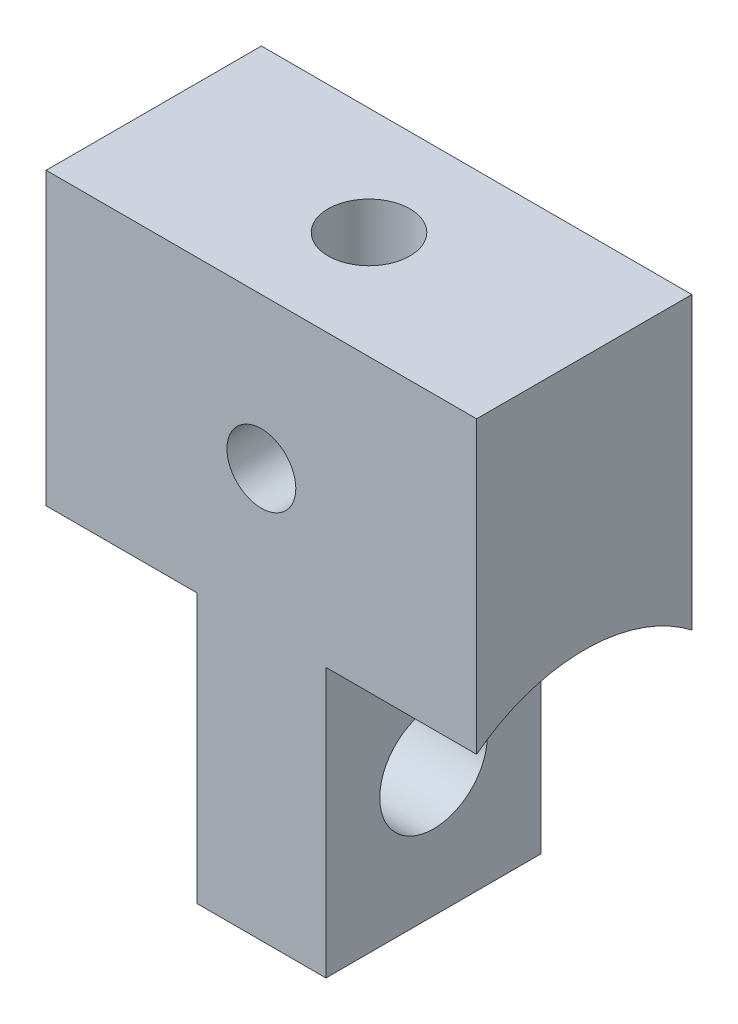
ISO-10303-21;
HEADER;
FILE_DESCRIPTION(('STEP AP214'),'2;1');
FILE_NAME('part.step','',(''),(''),'','','');
FILE_SCHEMA(('AUTOMOTIVE_DESIGN { 1 0 10303 214 1 1 1 1 }'));
ENDSEC;
DATA;
#1=APPLICATION_CONTEXT('core data for automotive mechanical design processes');
#2=APPLICATION_PROTOCOL_DEFINITION('international standard','automotive_design',2000,#1);
#3=PRODUCT_CONTEXT('',#1,'mechanical');
#4=PRODUCT('Part','Part','',(#3));
#5=PRODUCT_RELATED_PRODUCT_CATEGORY('part','',(#4));
#6=PRODUCT_DEFINITION_FORMATION('','',#4);
#7=PRODUCT_DEFINITION_CONTEXT('part definition',#1,'design');
#8=PRODUCT_DEFINITION('design','',#6,#7);
#9=PRODUCT_DEFINITION_SHAPE('','',#8);
#10=(LENGTH_UNIT() NAMED_UNIT(*) SI_UNIT(.MILLI.,.METRE.));
#11=(NAMED_UNIT(*) PLANE_ANGLE_UNIT() SI_UNIT($,.RADIAN.));
#12=(NAMED_UNIT(*) SI_UNIT($,.STERADIAN.) SOLID_ANGLE_UNIT());
#13=UNCERTAINTY_MEASURE_WITH_UNIT(LENGTH_MEASURE(1.E-05),#10,'distance_accuracy_value','');
#14=(GEOMETRIC_REPRESENTATION_CONTEXT(3) GLOBAL_UNCERTAINTY_ASSIGNED_CONTEXT((#13)) GLOBAL_UNIT_ASSIGNED_CONTEXT((#10,
#11,#12)) REPRESENTATION_CONTEXT('',''));
#15=CARTESIAN_POINT('',(0.,0.,0.));
#16=DIRECTION('',(0.,0.,1.));
#17=DIRECTION('',(1.,0.,0.));
#18=AXIS2_PLACEMENT_3D('',#15,#16,#17);
#19=CARTESIAN_POINT('',(0.,3.,5.));
#20=DIRECTION('',(0.,0.,-1.));
#21=DIRECTION('',(-1.,0.,0.));
#22=AXIS2_PLACEMENT_3D('',#19,#20,#21);
#23=CYLINDRICAL_SURFACE('',#22,0.8);
#24=CARTESIAN_POINT('',(0.,3.,5.));
#25=DIRECTION('',(0.,0.,1.));
#26=DIRECTION('',(1.,0.,0.));
#27=AXIS2_PLACEMENT_3D('',#24,#25,#26);
#28=CIRCLE('',#27,0.8);
#29=CARTESIAN_POINT('',(0.800000000000001,3.,5.));
#30=VERTEX_POINT('',#29);
#31=EDGE_CURVE('E179',#30,#30,#28,.T.);
#32=ORIENTED_EDGE('',*,*,#31,.T.);
#33=EDGE_LOOP('',(#32));
#34=FACE_BOUND('',#33,.T.);
#35=CARTESIAN_POINT('',(0.,3.,0.));
#36=DIRECTION('',(0.,0.,1.));
#37=DIRECTION('',(1.,0.,0.));
#38=AXIS2_PLACEMENT_3D('',#35,#36,#37);
#39=CIRCLE('',#38,0.8);
#40=CARTESIAN_POINT('',(0.800000000000001,3.,0.));
#41=VERTEX_POINT('',#40);
#42=EDGE_CURVE('E182',#41,#41,#39,.T.);
#43=ORIENTED_EDGE('',*,*,#42,.F.);
#44=EDGE_LOOP('',(#43));
#45=FACE_BOUND('',#44,.T.);
#46=CARTESIAN_POINT('',(0.624499799839844,3.5,3.21589105316382));
#47=CARTESIAN_POINT('',(0.596989446796808,3.53431435195809,3.23993184582808));
#48=CARTESIAN_POINT('',(0.566468990810766,3.56666598593497,3.26371468114399));
#49=CARTESIAN_POINT('',(0.499286045978184,3.62671853094582,3.30923352889173));
#50=CARTESIAN_POINT('',(0.462574101086611,3.65437807795749,3.33095066272691));
#51=CARTESIAN_POINT('',(0.391305200270369,3.69875943218527,3.36639071111825));
#52=CARTESIAN_POINT('',(0.357795075269994,3.71656229625455,3.38084325634962));
#53=CARTESIAN_POINT('',(0.287540557068154,3.74752169735336,3.40620513563468));
#54=CARTESIAN_POINT('',(0.250806353350745,3.76069225753749,3.41712515533806));
#55=CARTESIAN_POINT('',(0.174463699321532,3.78175562211247,3.43467004602641));
#56=CARTESIAN_POINT('',(0.13483229322757,3.78959970272312,3.44125524814546));
#57=CARTESIAN_POINT('',(0.0543042388616852,3.79918202346721,3.44930746544825));
#58=CARTESIAN_POINT('',(0.0134077265736145,3.80092091755081,3.45077502880195));
#59=CARTESIAN_POINT('',(-0.0625935805584883,3.79833165295423,3.44859555518797));
#60=CARTESIAN_POINT('',(-0.097747850614442,3.79477678136385,3.44560037974004));
#61=CARTESIAN_POINT('',(-0.166755012029901,3.78320871800817,3.43589855359897));
#62=CARTESIAN_POINT('',(-0.20060858744674,3.77519790498292,3.42919388317638));
#63=CARTESIAN_POINT('',(-0.266489482012972,3.75510255006901,3.41249541575778));
#64=CARTESIAN_POINT('',(-0.298501730583745,3.74298880799513,3.40247805506654));
#65=CARTESIAN_POINT('',(-0.360005326211795,3.71521846927709,3.37975887461044));
#66=CARTESIAN_POINT('',(-0.389490197726707,3.69955312600749,3.36705043263298));
#67=CARTESIAN_POINT('',(-0.458273036588351,3.65747385956863,3.33338875386017));
#68=CARTESIAN_POINT('',(-0.495993749193683,3.62939982473765,3.31130311992539));
#69=CARTESIAN_POINT('',(-0.565010201617233,3.56821065625755,3.26485374494461));
#70=CARTESIAN_POINT('',(-0.596343031870748,3.53512668852513,3.2405044244332));
#71=CARTESIAN_POINT('',(-0.624499799839841,3.5,3.21589105316381));
#72=B_SPLINE_CURVE_WITH_KNOTS('',3,(#46,#47,#48,#49,#50,#51,#52,#53,#54,#55,#56,#57,#58,#59,#60,
#61,#62,#63,#64,#65,#66,#67,#68,#69,#70,#71),.UNSPECIFIED.,.F.,.F.,(4,2,2,2,2,2,2,2,2,2,2,2,4),
(0.,0.150540881245239,0.302346746946312,0.423678394160233,0.544639512769526,0.666692728387727,
0.788732870015018,0.894604193645646,1.00041905356436,1.10700338996258,1.21385312209222,
1.36892840745186,1.52307587518184),.UNSPECIFIED.);
#73=CARTESIAN_POINT('',(0.624499799839844,3.5,3.21589105316382));
#74=VERTEX_POINT('',#73);
#75=CARTESIAN_POINT('',(-0.624499799839841,3.5,3.21589105316381));
#76=VERTEX_POINT('',#75);
#77=EDGE_CURVE('E43',#74,#76,#72,.T.);
#78=ORIENTED_EDGE('',*,*,#77,.F.);
#79=DIRECTION('',(0.,0.,-1.));
#80=VECTOR('',#79,1.);
#81=CARTESIAN_POINT('',(0.624499799839844,3.5,5.));
#82=LINE('',#81,#80);
#83=CARTESIAN_POINT('',(0.624499799839844,3.5,1.78410894683618));
#84=VERTEX_POINT('',#83);
#85=EDGE_CURVE('E12',#74,#84,#82,.T.);
#86=ORIENTED_EDGE('',*,*,#85,.T.);
#87=CARTESIAN_POINT('',(-0.624499799839841,3.5,1.78410894683619));
#88=CARTESIAN_POINT('',(-0.596989446796805,3.53431435195809,1.76006815417192));
#89=CARTESIAN_POINT('',(-0.566468990810763,3.56666598593497,1.73628531885602));
#90=CARTESIAN_POINT('',(-0.499286045978182,3.62671853094582,1.69076647110827));
#91=CARTESIAN_POINT('',(-0.462574101086608,3.65437807795749,1.66904933727309));
#92=CARTESIAN_POINT('',(-0.391305200270366,3.69875943218527,1.63360928888175));
#93=CARTESIAN_POINT('',(-0.357795075269991,3.71656229625455,1.61915674365038));
#94=CARTESIAN_POINT('',(-0.287540557068151,3.74752169735336,1.59379486436532));
#95=CARTESIAN_POINT('',(-0.250806353350742,3.76069225753749,1.58287484466194));
#96=CARTESIAN_POINT('',(-0.174463699321529,3.78175562211247,1.56532995397359));
#97=CARTESIAN_POINT('',(-0.134832293227568,3.78959970272312,1.55874475185454));
#98=CARTESIAN_POINT('',(-0.0543042388616826,3.79918202346721,1.55069253455175));
#99=CARTESIAN_POINT('',(-0.0134077265736119,3.80092091755081,1.54922497119805));
#100=CARTESIAN_POINT('',(0.0625935805584909,3.79833165295423,1.55140444481203));
#101=CARTESIAN_POINT('',(0.0977478506144447,3.79477678136385,1.55439962025996));
#102=CARTESIAN_POINT('',(0.166755012029903,3.78320871800817,1.56410144640103));
#103=CARTESIAN_POINT('',(0.200608587446743,3.77519790498292,1.57080611682362));
#104=CARTESIAN_POINT('',(0.266489482012974,3.75510255006901,1.58750458424222));
#105=CARTESIAN_POINT('',(0.298501730583748,3.74298880799513,1.59752194493345));
#106=CARTESIAN_POINT('',(0.360005326211798,3.71521846927709,1.62024112538956));
#107=CARTESIAN_POINT('',(0.38949019772671,3.69955312600749,1.63294956736702));
#108=CARTESIAN_POINT('',(0.458273036588353,3.65747385956863,1.66661124613983));
#109=CARTESIAN_POINT('',(0.495993749193685,3.62939982473764,1.6886968800746));
#110=CARTESIAN_POINT('',(0.565010201617235,3.56821065625755,1.73514625505539));
#111=CARTESIAN_POINT('',(0.596343031870751,3.53512668852512,1.7594955755668));
#112=CARTESIAN_POINT('',(0.624499799839844,3.5,1.78410894683618));
#113=B_SPLINE_CURVE_WITH_KNOTS('',3,(#87,#88,#89,#90,#91,#92,#93,#94,#95,#96,#97,#98,#99,#100,
#101,#102,#103,#104,#105,#106,#107,#108,#109,#110,#111,#112),.UNSPECIFIED.,.F.,.F.,(4,2,2,2,2,2,
2,2,2,2,2,2,4),(0.,0.15054088124524,0.302346746946313,0.423678394160234,0.544639512769527,
0.666692728387727,0.788732870015018,0.894604193645646,1.00041905356436,1.10700338996258,
1.21385312209222,1.36892840745186,1.52307587518184),.UNSPECIFIED.);
#114=CARTESIAN_POINT('',(-0.624499799839841,3.5,1.78410894683619));
#115=VERTEX_POINT('',#114);
#116=EDGE_CURVE('E122',#115,#84,#113,.T.);
#117=ORIENTED_EDGE('',*,*,#116,.F.);
#118=DIRECTION('',(0.,0.,-1.));
#119=VECTOR('',#118,1.);
#120=CARTESIAN_POINT('',(-0.624499799839841,3.5,5.));
#121=LINE('',#120,#119);
#122=EDGE_CURVE('E125',#115,#76,#121,.F.);
#123=ORIENTED_EDGE('',*,*,#122,.T.);
#124=EDGE_LOOP('',(#78,#86,#117,#123));
#125=FACE_BOUND('',#124,.T.);
#126=ADVANCED_FACE('F35',(#34,#45,#125),#23,.F.);
#127=CARTESIAN_POINT('',(0.,0.,5.));
#128=DIRECTION('',(0.,0.,-1.));
#129=DIRECTION('',(-1.,0.,0.));
#130=AXIS2_PLACEMENT_3D('',#127,#128,#129);
#131=PLANE('',#130);
#132=ORIENTED_EDGE('',*,*,#31,.F.);
#133=EDGE_LOOP('',(#132));
#134=FACE_BOUND('',#133,.T.);
#135=DIRECTION('',(1.,0.,0.));
#136=VECTOR('',#135,1.);
#137=CARTESIAN_POINT('',(-11.5965512114594,-0.250384638145621,5.));
#138=LINE('',#137,#136);
#139=CARTESIAN_POINT('',(5.,-0.250384638145624,5.));
#140=VERTEX_POINT('',#139);
#141=CARTESIAN_POINT('',(1.5,-0.250384638145623,5.));
#142=VERTEX_POINT('',#141);
#143=EDGE_CURVE('E243',#140,#142,#138,.F.);
#144=ORIENTED_EDGE('',*,*,#143,.F.);
#145=DIRECTION('',(0.,1.,0.));
#146=VECTOR('',#145,1.);
#147=CARTESIAN_POINT('',(5.,-6.50000000000001,5.));
#148=LINE('',#147,#146);
#149=CARTESIAN_POINT('',(5.,6.49999999999999,5.));
#150=VERTEX_POINT('',#149);
#151=EDGE_CURVE('E192',#140,#150,#148,.T.);
#152=ORIENTED_EDGE('',*,*,#151,.T.);
#153=DIRECTION('',(-1.,0.,0.));
#154=VECTOR('',#153,1.);
#155=CARTESIAN_POINT('',(-5.,6.5,5.));
#156=LINE('',#155,#154);
#157=CARTESIAN_POINT('',(-5.,6.5,5.));
#158=VERTEX_POINT('',#157);
#159=EDGE_CURVE('E194',#150,#158,#156,.T.);
#160=ORIENTED_EDGE('',*,*,#159,.T.);
#161=DIRECTION('',(0.,-1.,0.));
#162=VECTOR('',#161,1.);
#163=CARTESIAN_POINT('',(-4.99999999999999,-6.50000000000001,5.));
#164=LINE('',#163,#162);
#165=CARTESIAN_POINT('',(-5.,-0.250384638145624,5.));
#166=VERTEX_POINT('',#165);
#167=EDGE_CURVE('E197',#158,#166,#164,.T.);
#168=ORIENTED_EDGE('',*,*,#167,.T.);
#169=DIRECTION('',(-1.,0.,0.));
#170=VECTOR('',#169,1.);
#171=CARTESIAN_POINT('',(11.5965512114594,-0.250384638145621,5.));
#172=LINE('',#171,#170);
#173=CARTESIAN_POINT('',(-1.5,-0.250384638145624,5.));
#174=VERTEX_POINT('',#173);
#175=EDGE_CURVE('E184',#166,#174,#172,.F.);
#176=ORIENTED_EDGE('',*,*,#175,.T.);
#177=DIRECTION('',(0.,-1.,0.));
#178=VECTOR('',#177,1.);
#179=CARTESIAN_POINT('',(-1.5,0.,5.));
#180=LINE('',#179,#178);
#181=CARTESIAN_POINT('',(-1.5,-6.50000000000001,5.));
#182=VERTEX_POINT('',#181);
#183=EDGE_CURVE('E252',#174,#182,#180,.T.);
#184=ORIENTED_EDGE('',*,*,#183,.T.);
#185=DIRECTION('',(1.,0.,0.));
#186=VECTOR('',#185,1.);
#187=CARTESIAN_POINT('',(-4.99999999999999,-6.50000000000001,5.));
#188=LINE('',#187,#186);
#189=CARTESIAN_POINT('',(1.5,-6.50000000000001,5.));
#190=VERTEX_POINT('',#189);
#191=EDGE_CURVE('E200',#182,#190,#188,.T.);
#192=ORIENTED_EDGE('',*,*,#191,.T.);
#193=DIRECTION('',(0.,-1.,0.));
#194=VECTOR('',#193,1.);
#195=CARTESIAN_POINT('',(1.5,0.,5.));
#196=LINE('',#195,#194);
#197=EDGE_CURVE('E57',#142,#190,#196,.T.);
#198=ORIENTED_EDGE('',*,*,#197,.F.);
#199=EDGE_LOOP('',(#144,#152,#160,#168,#176,#184,#192,#198));
#200=FACE_BOUND('',#199,.T.);
#201=ADVANCED_FACE('F169',(#134,#200),#131,.F.);
#202=CARTESIAN_POINT('',(0.,0.,0.));
#203=DIRECTION('',(0.,0.,-1.));
#204=DIRECTION('',(-1.,0.,0.));
#205=AXIS2_PLACEMENT_3D('',#202,#203,#204);
#206=PLANE('',#205);
#207=ORIENTED_EDGE('',*,*,#42,.T.);
#208=EDGE_LOOP('',(#207));
#209=FACE_BOUND('',#208,.T.);
#210=DIRECTION('',(0.,1.,0.));
#211=VECTOR('',#210,1.);
#212=CARTESIAN_POINT('',(5.,-6.50000000000001,0.));
#213=LINE('',#212,#211);
#214=CARTESIAN_POINT('',(5.,-0.250384638145624,0.));
#215=VERTEX_POINT('',#214);
#216=CARTESIAN_POINT('',(5.,6.49999999999999,0.));
#217=VERTEX_POINT('',#216);
#218=EDGE_CURVE('E186',#215,#217,#213,.T.);
#219=ORIENTED_EDGE('',*,*,#218,.F.);
#220=DIRECTION('',(1.,0.,0.));
#221=VECTOR('',#220,1.);
#222=CARTESIAN_POINT('',(-11.5965512114594,-0.250384638145621,0.));
#223=LINE('',#222,#221);
#224=CARTESIAN_POINT('',(1.5,-0.250384638145623,0.));
#225=VERTEX_POINT('',#224);
#226=EDGE_CURVE('E240',#215,#225,#223,.F.);
#227=ORIENTED_EDGE('',*,*,#226,.T.);
#228=DIRECTION('',(0.,-1.,0.));
#229=VECTOR('',#228,1.);
#230=CARTESIAN_POINT('',(1.5,0.,0.));
#231=LINE('',#230,#229);
#232=CARTESIAN_POINT('',(1.5,-6.50000000000001,0.));
#233=VERTEX_POINT('',#232);
#234=EDGE_CURVE('E235',#225,#233,#231,.T.);
#235=ORIENTED_EDGE('',*,*,#234,.T.);
#236=DIRECTION('',(1.,0.,0.));
#237=VECTOR('',#236,1.);
#238=CARTESIAN_POINT('',(-4.99999999999999,-6.50000000000001,0.));
#239=LINE('',#238,#237);
#240=CARTESIAN_POINT('',(-1.5,-6.50000000000001,0.));
#241=VERTEX_POINT('',#240);
#242=EDGE_CURVE('E195',#241,#233,#239,.T.);
#243=ORIENTED_EDGE('',*,*,#242,.F.);
#244=DIRECTION('',(0.,-1.,0.));
#245=VECTOR('',#244,1.);
#246=CARTESIAN_POINT('',(-1.5,0.,0.));
#247=LINE('',#246,#245);
#248=CARTESIAN_POINT('',(-1.5,-0.250384638145624,0.));
#249=VERTEX_POINT('',#248);
#250=EDGE_CURVE('E250',#249,#241,#247,.T.);
#251=ORIENTED_EDGE('',*,*,#250,.F.);
#252=DIRECTION('',(-1.,0.,0.));
#253=VECTOR('',#252,1.);
#254=CARTESIAN_POINT('',(11.5965512114594,-0.250384638145621,0.));
#255=LINE('',#254,#253);
#256=CARTESIAN_POINT('',(-5.,-0.250384638145624,0.));
#257=VERTEX_POINT('',#256);
#258=EDGE_CURVE('E189',#257,#249,#255,.F.);
#259=ORIENTED_EDGE('',*,*,#258,.F.);
#260=DIRECTION('',(0.,-1.,0.));
#261=VECTOR('',#260,1.);
#262=CARTESIAN_POINT('',(-4.99999999999999,-6.50000000000001,0.));
#263=LINE('',#262,#261);
#264=CARTESIAN_POINT('',(-5.,6.5,0.));
#265=VERTEX_POINT('',#264);
#266=EDGE_CURVE('E207',#265,#257,#263,.T.);
#267=ORIENTED_EDGE('',*,*,#266,.F.);
#268=DIRECTION('',(-1.,0.,0.));
#269=VECTOR('',#268,1.);
#270=CARTESIAN_POINT('',(-5.,6.5,0.));
#271=LINE('',#270,#269);
#272=EDGE_CURVE('E205',#217,#265,#271,.T.);
#273=ORIENTED_EDGE('',*,*,#272,.F.);
#274=EDGE_LOOP('',(#219,#227,#235,#243,#251,#259,#267,#273));
#275=FACE_BOUND('',#274,.T.);
#276=ADVANCED_FACE('F174',(#209,#275),#206,.T.);
#277=CARTESIAN_POINT('',(-4.99999999999999,-6.50000000000001,5.));
#278=DIRECTION('',(0.,1.,0.));
#279=DIRECTION('',(-1.,0.,0.));
#280=AXIS2_PLACEMENT_3D('',#277,#278,#279);
#281=PLANE('',#280);
#282=DIRECTION('',(0.,0.,-1.));
#283=VECTOR('',#282,1.);
#284=CARTESIAN_POINT('',(1.5,-6.50000000000001,5.));
#285=LINE('',#284,#283);
#286=EDGE_CURVE('E220',#190,#233,#285,.T.);
#287=ORIENTED_EDGE('',*,*,#286,.F.);
#288=ORIENTED_EDGE('',*,*,#191,.F.);
#289=DIRECTION('',(0.,0.,-1.));
#290=VECTOR('',#289,1.);
#291=CARTESIAN_POINT('',(-1.5,-6.50000000000001,5.));
#292=LINE('',#291,#290);
#293=EDGE_CURVE('E217',#182,#241,#292,.T.);
#294=ORIENTED_EDGE('',*,*,#293,.T.);
#295=ORIENTED_EDGE('',*,*,#242,.T.);
#296=EDGE_LOOP('',(#287,#288,#294,#295));
#297=FACE_BOUND('',#296,.T.);
#298=ADVANCED_FACE('F264',(#297),#281,.F.);
#299=CARTESIAN_POINT('',(5.,-6.50000000000001,5.));
#300=DIRECTION('',(-1.,0.,0.));
#301=DIRECTION('',(0.,-1.,0.));
#302=AXIS2_PLACEMENT_3D('',#299,#300,#301);
#303=PLANE('',#302);
#304=CARTESIAN_POINT('',(4.99999999999999,-3.50000000000001,2.5));
#305=DIRECTION('',(-1.,0.,0.));
#306=DIRECTION('',(0.,-1.,0.));
#307=AXIS2_PLACEMENT_3D('',#304,#305,#306);
#308=CIRCLE('',#307,4.1);
#309=EDGE_CURVE('E224',#140,#215,#308,.T.);
#310=ORIENTED_EDGE('',*,*,#309,.T.);
#311=ORIENTED_EDGE('',*,*,#218,.T.);
#312=DIRECTION('',(0.,0.,-1.));
#313=VECTOR('',#312,1.);
#314=CARTESIAN_POINT('',(5.,6.49999999999999,5.));
#315=LINE('',#314,#313);
#316=EDGE_CURVE('E214',#150,#217,#315,.T.);
#317=ORIENTED_EDGE('',*,*,#316,.F.);
#318=ORIENTED_EDGE('',*,*,#151,.F.);
#319=EDGE_LOOP('',(#310,#311,#317,#318));
#320=FACE_BOUND('',#319,.T.);
#321=ADVANCED_FACE('F37',(#320),#303,.F.);
#322=CARTESIAN_POINT('',(-5.,6.5,5.));
#323=DIRECTION('',(0.,-1.,0.));
#324=DIRECTION('',(1.,0.,0.));
#325=AXIS2_PLACEMENT_3D('',#322,#323,#324);
#326=PLANE('',#325);
#327=CARTESIAN_POINT('',(0.,6.5,2.5));
#328=DIRECTION('',(0.,1.,0.));
#329=DIRECTION('',(-1.,0.,0.));
#330=AXIS2_PLACEMENT_3D('',#327,#328,#329);
#331=CIRCLE('',#330,0.95);
#332=CARTESIAN_POINT('',(-0.949999999999996,6.5,2.5));
#333=VERTEX_POINT('',#332);
#334=EDGE_CURVE('E234',#333,#333,#331,.T.);
#335=ORIENTED_EDGE('',*,*,#334,.F.);
#336=EDGE_LOOP('',(#335));
#337=FACE_BOUND('',#336,.T.);
#338=ORIENTED_EDGE('',*,*,#272,.T.);
#339=DIRECTION('',(0.,0.,-1.));
#340=VECTOR('',#339,1.);
#341=CARTESIAN_POINT('',(-5.,6.5,5.));
#342=LINE('',#341,#340);
#343=EDGE_CURVE('E203',#158,#265,#342,.T.);
#344=ORIENTED_EDGE('',*,*,#343,.F.);
#345=ORIENTED_EDGE('',*,*,#159,.F.);
#346=ORIENTED_EDGE('',*,*,#316,.T.);
#347=EDGE_LOOP('',(#338,#344,#345,#346));
#348=FACE_BOUND('',#347,.T.);
#349=ADVANCED_FACE('F275',(#337,#348),#326,.F.);
#350=CARTESIAN_POINT('',(-4.99999999999999,-6.50000000000001,5.));
#351=DIRECTION('',(1.,0.,0.));
#352=DIRECTION('',(0.,1.,0.));
#353=AXIS2_PLACEMENT_3D('',#350,#351,#352);
#354=PLANE('',#353);
#355=ORIENTED_EDGE('',*,*,#266,.T.);
#356=CARTESIAN_POINT('',(-4.99999999999999,-3.50000000000001,2.5));
#357=DIRECTION('',(-1.,0.,0.));
#358=DIRECTION('',(0.,-1.,0.));
#359=AXIS2_PLACEMENT_3D('',#356,#357,#358);
#360=CIRCLE('',#359,4.1);
#361=EDGE_CURVE('E245',#166,#257,#360,.T.);
#362=ORIENTED_EDGE('',*,*,#361,.F.);
#363=ORIENTED_EDGE('',*,*,#167,.F.);
#364=ORIENTED_EDGE('',*,*,#343,.T.);
#365=EDGE_LOOP('',(#355,#362,#363,#364));
#366=FACE_BOUND('',#365,.T.);
#367=ADVANCED_FACE('F160',(#366),#354,.F.);
#368=CARTESIAN_POINT('',(11.5965512114594,-3.5,2.5));
#369=DIRECTION('',(-1.,0.,0.));
#370=DIRECTION('',(0.,-1.,0.));
#371=AXIS2_PLACEMENT_3D('',#368,#369,#370);
#372=CYLINDRICAL_SURFACE('',#371,4.1);
#373=ORIENTED_EDGE('',*,*,#361,.T.);
#374=ORIENTED_EDGE('',*,*,#258,.T.);
#375=CARTESIAN_POINT('',(-1.5,-3.50000000000001,2.5));
#376=DIRECTION('',(1.,0.,0.));
#377=DIRECTION('',(0.,0.,-1.));
#378=AXIS2_PLACEMENT_3D('',#375,#376,#377);
#379=CIRCLE('',#378,4.1);
#380=EDGE_CURVE('E247',#174,#249,#379,.F.);
#381=ORIENTED_EDGE('',*,*,#380,.F.);
#382=ORIENTED_EDGE('',*,*,#175,.F.);
#383=EDGE_LOOP('',(#373,#374,#381,#382));
#384=FACE_BOUND('',#383,.T.);
#385=ADVANCED_FACE('F158',(#384),#372,.F.);
#386=CARTESIAN_POINT('',(-1.5,0.,0.));
#387=DIRECTION('',(1.,0.,0.));
#388=DIRECTION('',(0.,0.,-1.));
#389=AXIS2_PLACEMENT_3D('',#386,#387,#388);
#390=PLANE('',#389);
#391=CARTESIAN_POINT('',(-1.5,-3.50000000000001,2.5));
#392=DIRECTION('',(-1.,0.,0.));
#393=DIRECTION('',(0.,0.,1.));
#394=AXIS2_PLACEMENT_3D('',#391,#392,#393);
#395=CIRCLE('',#394,1.25);
#396=CARTESIAN_POINT('',(-1.5,-3.50000000000001,3.75));
#397=VERTEX_POINT('',#396);
#398=EDGE_CURVE('E123',#397,#397,#395,.T.);
#399=ORIENTED_EDGE('',*,*,#398,.F.);
#400=EDGE_LOOP('',(#399));
#401=FACE_BOUND('',#400,.T.);
#402=ORIENTED_EDGE('',*,*,#380,.T.);
#403=ORIENTED_EDGE('',*,*,#250,.T.);
#404=ORIENTED_EDGE('',*,*,#293,.F.);
#405=ORIENTED_EDGE('',*,*,#183,.F.);
#406=EDGE_LOOP('',(#402,#403,#404,#405));
#407=FACE_BOUND('',#406,.T.);
#408=ADVANCED_FACE('F156',(#401,#407),#390,.F.);
#409=CARTESIAN_POINT('',(-11.5965512114594,-3.5,2.5));
#410=DIRECTION('',(1.,0.,0.));
#411=DIRECTION('',(0.,1.,0.));
#412=AXIS2_PLACEMENT_3D('',#409,#410,#411);
#413=CYLINDRICAL_SURFACE('',#412,4.1);
#414=ORIENTED_EDGE('',*,*,#143,.T.);
#415=CARTESIAN_POINT('',(1.5,-3.50000000000001,2.5));
#416=DIRECTION('',(1.,0.,0.));
#417=DIRECTION('',(0.,0.,-1.));
#418=AXIS2_PLACEMENT_3D('',#415,#416,#417);
#419=CIRCLE('',#418,4.1);
#420=EDGE_CURVE('E227',#225,#142,#419,.T.);
#421=ORIENTED_EDGE('',*,*,#420,.F.);
#422=ORIENTED_EDGE('',*,*,#226,.F.);
#423=ORIENTED_EDGE('',*,*,#309,.F.);
#424=EDGE_LOOP('',(#414,#421,#422,#423));
#425=FACE_BOUND('',#424,.T.);
#426=ADVANCED_FACE('F152',(#425),#413,.F.);
#427=CARTESIAN_POINT('',(1.5,0.,0.));
#428=DIRECTION('',(1.,0.,0.));
#429=DIRECTION('',(0.,0.,-1.));
#430=AXIS2_PLACEMENT_3D('',#427,#428,#429);
#431=PLANE('',#430);
#432=CARTESIAN_POINT('',(1.5,-3.50000000000001,2.5));
#433=DIRECTION('',(1.,0.,0.));
#434=DIRECTION('',(0.,0.,-1.));
#435=AXIS2_PLACEMENT_3D('',#432,#433,#434);
#436=CIRCLE('',#435,1.25);
#437=CARTESIAN_POINT('',(1.5,-3.50000000000001,1.25));
#438=VERTEX_POINT('',#437);
#439=EDGE_CURVE('E222',#438,#438,#436,.T.);
#440=ORIENTED_EDGE('',*,*,#439,.F.);
#441=EDGE_LOOP('',(#440));
#442=FACE_BOUND('',#441,.T.);
#443=ORIENTED_EDGE('',*,*,#197,.T.);
#444=ORIENTED_EDGE('',*,*,#286,.T.);
#445=ORIENTED_EDGE('',*,*,#234,.F.);
#446=ORIENTED_EDGE('',*,*,#420,.T.);
#447=EDGE_LOOP('',(#443,#444,#445,#446));
#448=FACE_BOUND('',#447,.T.);
#449=ADVANCED_FACE('F148',(#442,#448),#431,.T.);
#450=CARTESIAN_POINT('',(5.,-3.50000000000001,2.5));
#451=DIRECTION('',(-1.,0.,0.));
#452=DIRECTION('',(0.,0.,1.));
#453=AXIS2_PLACEMENT_3D('',#450,#451,#452);
#454=CYLINDRICAL_SURFACE('',#453,1.25);
#455=ORIENTED_EDGE('',*,*,#439,.T.);
#456=EDGE_LOOP('',(#455));
#457=FACE_BOUND('',#456,.T.);
#458=ORIENTED_EDGE('',*,*,#398,.T.);
#459=EDGE_LOOP('',(#458));
#460=FACE_BOUND('',#459,.T.);
#461=ADVANCED_FACE('F144',(#457,#460),#454,.F.);
#462=CARTESIAN_POINT('',(0.,3.5,2.5));
#463=DIRECTION('',(0.,1.,0.));
#464=DIRECTION('',(-1.,0.,0.));
#465=AXIS2_PLACEMENT_3D('',#462,#463,#464);
#466=PLANE('',#465);
#467=CARTESIAN_POINT('',(0.,3.5,2.5));
#468=DIRECTION('',(0.,1.,0.));
#469=DIRECTION('',(-1.,0.,0.));
#470=AXIS2_PLACEMENT_3D('',#467,#468,#469);
#471=CIRCLE('',#470,0.95);
#472=EDGE_CURVE('E114',#74,#84,#471,.T.);
#473=ORIENTED_EDGE('',*,*,#472,.T.);
#474=ORIENTED_EDGE('',*,*,#85,.F.);
#475=EDGE_LOOP('',(#473,#474));
#476=FACE_BOUND('',#475,.T.);
#477=ADVANCED_FACE('F113',(#476),#466,.T.);
#478=CARTESIAN_POINT('',(0.,3.5,2.5));
#479=DIRECTION('',(0.,1.,0.));
#480=DIRECTION('',(-1.,0.,0.));
#481=AXIS2_PLACEMENT_3D('',#478,#479,#480);
#482=CYLINDRICAL_SURFACE('',#481,0.95);
#483=ORIENTED_EDGE('',*,*,#77,.T.);
#484=EDGE_CURVE('E49',#115,#76,#471,.T.);
#485=ORIENTED_EDGE('',*,*,#484,.F.);
#486=ORIENTED_EDGE('',*,*,#116,.T.);
#487=ORIENTED_EDGE('',*,*,#472,.F.);
#488=EDGE_LOOP('',(#483,#485,#486,#487));
#489=FACE_BOUND('',#488,.T.);
#490=ORIENTED_EDGE('',*,*,#334,.T.);
#491=EDGE_LOOP('',(#490));
#492=FACE_BOUND('',#491,.T.);
#493=ADVANCED_FACE('F119',(#489,#492),#482,.F.);
#494=ORIENTED_EDGE('',*,*,#484,.T.);
#495=ORIENTED_EDGE('',*,*,#122,.F.);
#496=EDGE_LOOP('',(#494,#495));
#497=FACE_BOUND('',#496,.T.);
#498=ADVANCED_FACE('F143',(#497),#466,.T.);
#499=CLOSED_SHELL('',(#126,#201,#276,#298,#321,#349,#367,#385,#408,#426,#449,#461,#477,#493,#498));
#500=MANIFOLD_SOLID_BREP('B2',#499);
#501=ADVANCED_BREP_SHAPE_REPRESENTATION('',(#18,#500),#14);
#502=SHAPE_DEFINITION_REPRESENTATION(#9,#501);
ENDSEC;
END-ISO-10303-21;
